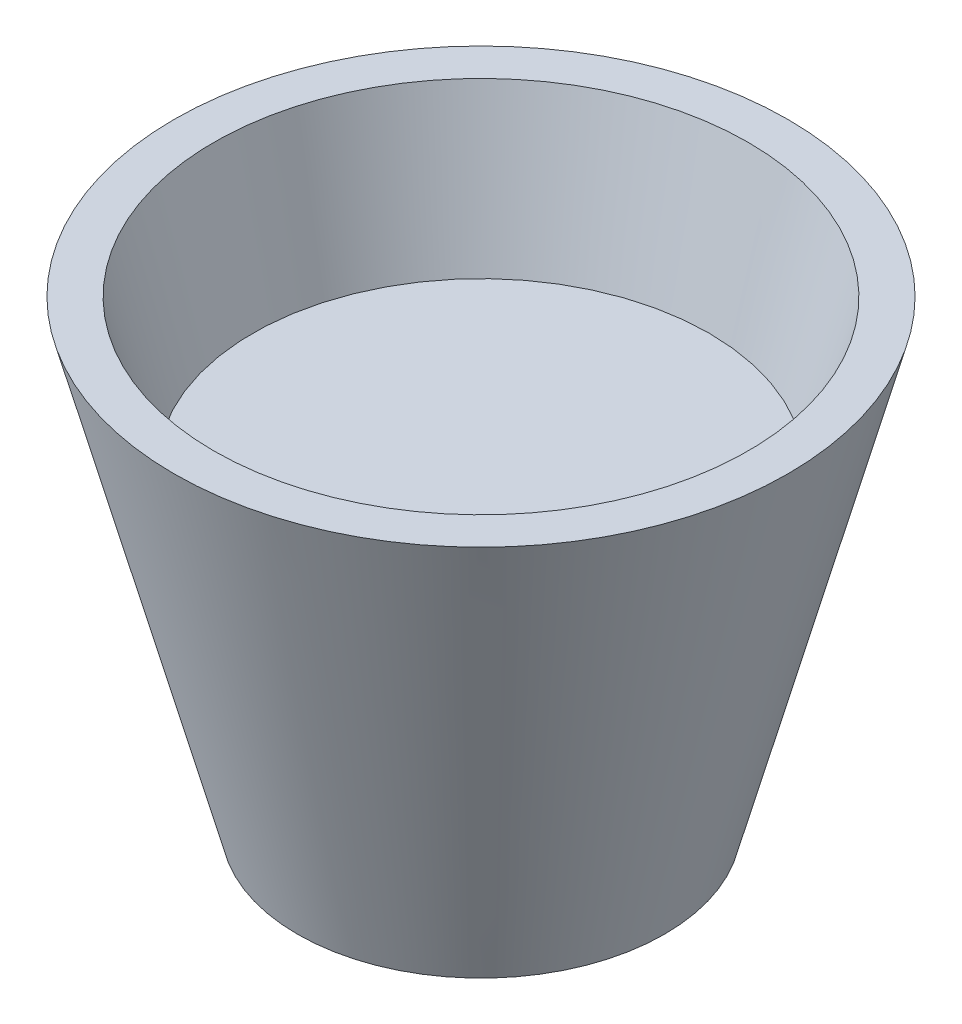
ISO-10303-21;
HEADER;
FILE_DESCRIPTION(('STEP AP214'),'2;1');
FILE_NAME('part.step','',(''),(''),'','','');
FILE_SCHEMA(('AUTOMOTIVE_DESIGN { 1 0 10303 214 1 1 1 1 }'));
ENDSEC;
DATA;
#1=APPLICATION_CONTEXT('core data for automotive mechanical design processes');
#2=APPLICATION_PROTOCOL_DEFINITION('international standard','automotive_design',2000,#1);
#3=PRODUCT_CONTEXT('',#1,'mechanical');
#4=PRODUCT('Part','Part','',(#3));
#5=PRODUCT_RELATED_PRODUCT_CATEGORY('part','',(#4));
#6=PRODUCT_DEFINITION_FORMATION('','',#4);
#7=PRODUCT_DEFINITION_CONTEXT('part definition',#1,'design');
#8=PRODUCT_DEFINITION('design','',#6,#7);
#9=PRODUCT_DEFINITION_SHAPE('','',#8);
#10=(LENGTH_UNIT() NAMED_UNIT(*) SI_UNIT(.MILLI.,.METRE.));
#11=(NAMED_UNIT(*) PLANE_ANGLE_UNIT() SI_UNIT($,.RADIAN.));
#12=(NAMED_UNIT(*) SI_UNIT($,.STERADIAN.) SOLID_ANGLE_UNIT());
#13=UNCERTAINTY_MEASURE_WITH_UNIT(LENGTH_MEASURE(1.E-05),#10,'distance_accuracy_value','');
#14=(GEOMETRIC_REPRESENTATION_CONTEXT(3) GLOBAL_UNCERTAINTY_ASSIGNED_CONTEXT((#13)) GLOBAL_UNIT_ASSIGNED_CONTEXT((#10,
#11,#12)) REPRESENTATION_CONTEXT('',''));
#15=CARTESIAN_POINT('',(0.,0.,0.));
#16=DIRECTION('',(0.,0.,1.));
#17=DIRECTION('',(1.,0.,0.));
#18=AXIS2_PLACEMENT_3D('',#15,#16,#17);
#19=CARTESIAN_POINT('',(0.,0.,0.));
#20=DIRECTION('',(0.,-1.,0.));
#21=DIRECTION('',(0.,0.,-1.));
#22=AXIS2_PLACEMENT_3D('',#19,#20,#21);
#23=PLANE('',#22);
#24=CARTESIAN_POINT('',(0.,0.,0.));
#25=DIRECTION('',(0.,-1.,0.));
#26=DIRECTION('',(0.,0.,-1.));
#27=AXIS2_PLACEMENT_3D('',#24,#25,#26);
#28=CIRCLE('',#27,25.5229038677263);
#29=CARTESIAN_POINT('',(0.,0.,-25.5229038677263));
#30=VERTEX_POINT('',#29);
#31=EDGE_CURVE('E11',#30,#30,#28,.T.);
#32=ORIENTED_EDGE('',*,*,#31,.T.);
#33=EDGE_LOOP('',(#32));
#34=FACE_BOUND('',#33,.T.);
#35=ADVANCED_FACE('F42',(#34),#23,.T.);
#36=CARTESIAN_POINT('',(0.,0.,0.));
#37=DIRECTION('',(0.,1.,0.));
#38=DIRECTION('',(0.,0.,1.));
#39=AXIS2_PLACEMENT_3D('',#36,#37,#38);
#40=CONICAL_SURFACE('',#39,25.5229038677263,0.264961035020304);
#41=CARTESIAN_POINT('',(0.,45.7286981183239,0.));
#42=DIRECTION('',(0.,-1.,0.));
#43=DIRECTION('',(0.,0.,-1.));
#44=AXIS2_PLACEMENT_3D('',#41,#42,#43);
#45=CIRCLE('',#44,37.9309617480363);
#46=CARTESIAN_POINT('',(0.,45.7286981183239,-37.9309617480363));
#47=VERTEX_POINT('',#46);
#48=EDGE_CURVE('E48',#47,#47,#45,.T.);
#49=ORIENTED_EDGE('',*,*,#48,.T.);
#50=EDGE_LOOP('',(#49));
#51=FACE_BOUND('',#50,.T.);
#52=ORIENTED_EDGE('',*,*,#31,.F.);
#53=EDGE_LOOP('',(#52));
#54=FACE_BOUND('',#53,.T.);
#55=ADVANCED_FACE('F54',(#51,#54),#40,.T.);
#56=CARTESIAN_POINT('',(37.9309617480363,45.7286981183239,0.));
#57=DIRECTION('',(0.,1.,0.));
#58=DIRECTION('',(0.,0.,1.));
#59=AXIS2_PLACEMENT_3D('',#56,#57,#58);
#60=PLANE('',#59);
#61=ORIENTED_EDGE('',*,*,#48,.F.);
#62=EDGE_LOOP('',(#61));
#63=FACE_BOUND('',#62,.T.);
#64=ADVANCED_FACE('F57',(#63),#60,.T.);
#65=CLOSED_SHELL('',(#35,#55,#64));
#66=MANIFOLD_SOLID_BREP('B2',#65);
#67=CARTESIAN_POINT('',(0.,0.,0.));
#68=DIRECTION('',(0.,1.,0.));
#69=DIRECTION('',(0.,0.,1.));
#70=AXIS2_PLACEMENT_3D('',#67,#68,#69);
#71=PLANE('',#70);
#72=CARTESIAN_POINT('',(0.,0.,0.));
#73=DIRECTION('',(0.,-1.,0.));
#74=DIRECTION('',(0.,0.,-1.));
#75=AXIS2_PLACEMENT_3D('',#72,#73,#74);
#76=CIRCLE('',#75,25.5097451630823);
#77=CARTESIAN_POINT('',(0.,0.,-25.5097451630823));
#78=VERTEX_POINT('',#77);
#79=EDGE_CURVE('E41',#78,#78,#76,.T.);
#80=ORIENTED_EDGE('',*,*,#79,.F.);
#81=EDGE_LOOP('',(#80));
#82=FACE_BOUND('',#81,.T.);
#83=ADVANCED_FACE('F82',(#82),#71,.T.);
#84=CARTESIAN_POINT('',(0.,69.85,0.));
#85=DIRECTION('',(0.,1.,0.));
#86=DIRECTION('',(0.,0.,1.));
#87=AXIS2_PLACEMENT_3D('',#84,#85,#86);
#88=CONICAL_SURFACE('',#87,44.225996254396,0.261799387799146);
#89=ORIENTED_EDGE('',*,*,#79,.T.);
#90=EDGE_LOOP('',(#89));
#91=FACE_BOUND('',#90,.T.);
#92=CARTESIAN_POINT('',(0.,69.85,0.));
#93=DIRECTION('',(0.,-1.,0.));
#94=DIRECTION('',(0.,0.,-1.));
#95=AXIS2_PLACEMENT_3D('',#92,#93,#94);
#96=CIRCLE('',#95,44.225996254396);
#97=CARTESIAN_POINT('',(0.,69.85,-44.225996254396));
#98=VERTEX_POINT('',#97);
#99=EDGE_CURVE('E88',#98,#98,#96,.T.);
#100=ORIENTED_EDGE('',*,*,#99,.F.);
#101=EDGE_LOOP('',(#100));
#102=FACE_BOUND('',#101,.T.);
#103=ADVANCED_FACE('F114',(#91,#102),#88,.F.);
#104=CARTESIAN_POINT('',(44.225996254396,69.85,0.));
#105=DIRECTION('',(0.,1.,0.));
#106=DIRECTION('',(0.,0.,1.));
#107=AXIS2_PLACEMENT_3D('',#104,#105,#106);
#108=PLANE('',#107);
#109=ORIENTED_EDGE('',*,*,#99,.T.);
#110=EDGE_LOOP('',(#109));
#111=FACE_BOUND('',#110,.T.);
#112=CARTESIAN_POINT('',(0.,69.85,0.));
#113=DIRECTION('',(0.,-1.,0.));
#114=DIRECTION('',(0.,0.,-1.));
#115=AXIS2_PLACEMENT_3D('',#112,#113,#114);
#116=CIRCLE('',#115,50.8);
#117=CARTESIAN_POINT('',(0.,69.85,-50.8));
#118=VERTEX_POINT('',#117);
#119=EDGE_CURVE('E92',#118,#118,#116,.T.);
#120=ORIENTED_EDGE('',*,*,#119,.F.);
#121=EDGE_LOOP('',(#120));
#122=FACE_BOUND('',#121,.T.);
#123=ADVANCED_FACE('F106',(#111,#122),#108,.T.);
#124=CARTESIAN_POINT('',(0.,-6.34999999999999,0.));
#125=DIRECTION('',(0.,1.,0.));
#126=DIRECTION('',(0.,0.,1.));
#127=AXIS2_PLACEMENT_3D('',#124,#125,#126);
#128=CONICAL_SURFACE('',#127,30.3822715367487,0.261799387799146);
#129=ORIENTED_EDGE('',*,*,#119,.T.);
#130=EDGE_LOOP('',(#129));
#131=FACE_BOUND('',#130,.T.);
#132=CARTESIAN_POINT('',(0.,-6.34999999999999,0.));
#133=DIRECTION('',(0.,-1.,0.));
#134=DIRECTION('',(0.,0.,-1.));
#135=AXIS2_PLACEMENT_3D('',#132,#133,#134);
#136=CIRCLE('',#135,30.3822715367487);
#137=CARTESIAN_POINT('',(0.,-6.34999999999999,-30.3822715367487));
#138=VERTEX_POINT('',#137);
#139=EDGE_CURVE('E96',#138,#138,#136,.T.);
#140=ORIENTED_EDGE('',*,*,#139,.F.);
#141=EDGE_LOOP('',(#140));
#142=FACE_BOUND('',#141,.T.);
#143=ADVANCED_FACE('F104',(#131,#142),#128,.T.);
#144=CARTESIAN_POINT('',(30.3822715367487,-6.35,0.));
#145=DIRECTION('',(0.,-1.,0.));
#146=DIRECTION('',(0.,0.,-1.));
#147=AXIS2_PLACEMENT_3D('',#144,#145,#146);
#148=PLANE('',#147);
#149=ORIENTED_EDGE('',*,*,#139,.T.);
#150=EDGE_LOOP('',(#149));
#151=FACE_BOUND('',#150,.T.);
#152=ADVANCED_FACE('F102',(#151),#148,.T.);
#153=CLOSED_SHELL('',(#83,#103,#123,#143,#152));
#154=MANIFOLD_SOLID_BREP('B6',#153);
#155=ADVANCED_BREP_SHAPE_REPRESENTATION('',(#18,#66,#154),#14);
#156=SHAPE_DEFINITION_REPRESENTATION(#9,#155);
ENDSEC;
END-ISO-10303-21;
